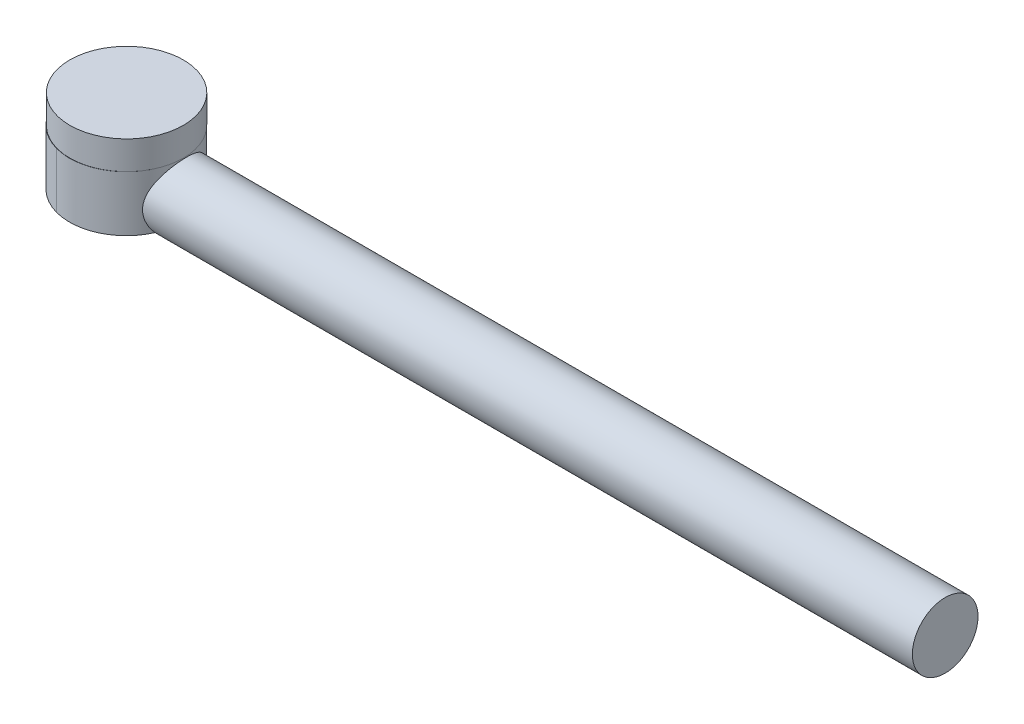
ISO-10303-21;
HEADER;
FILE_DESCRIPTION(('STEP AP214'),'2;1');
FILE_NAME('part.step','',(''),(''),'','','');
FILE_SCHEMA(('AUTOMOTIVE_DESIGN { 1 0 10303 214 1 1 1 1 }'));
ENDSEC;
DATA;
#1=APPLICATION_CONTEXT('core data for automotive mechanical design processes');
#2=APPLICATION_PROTOCOL_DEFINITION('international standard','automotive_design',2000,#1);
#3=PRODUCT_CONTEXT('',#1,'mechanical');
#4=PRODUCT('Part','Part','',(#3));
#5=PRODUCT_RELATED_PRODUCT_CATEGORY('part','',(#4));
#6=PRODUCT_DEFINITION_FORMATION('','',#4);
#7=PRODUCT_DEFINITION_CONTEXT('part definition',#1,'design');
#8=PRODUCT_DEFINITION('design','',#6,#7);
#9=PRODUCT_DEFINITION_SHAPE('','',#8);
#10=(LENGTH_UNIT() NAMED_UNIT(*) SI_UNIT(.MILLI.,.METRE.));
#11=(NAMED_UNIT(*) PLANE_ANGLE_UNIT() SI_UNIT($,.RADIAN.));
#12=(NAMED_UNIT(*) SI_UNIT($,.STERADIAN.) SOLID_ANGLE_UNIT());
#13=UNCERTAINTY_MEASURE_WITH_UNIT(LENGTH_MEASURE(1.E-05),#10,'distance_accuracy_value','');
#14=(GEOMETRIC_REPRESENTATION_CONTEXT(3) GLOBAL_UNCERTAINTY_ASSIGNED_CONTEXT((#13)) GLOBAL_UNIT_ASSIGNED_CONTEXT((#10,
#11,#12)) REPRESENTATION_CONTEXT('',''));
#15=CARTESIAN_POINT('',(0.,0.,0.));
#16=DIRECTION('',(0.,0.,1.));
#17=DIRECTION('',(1.,0.,0.));
#18=AXIS2_PLACEMENT_3D('',#15,#16,#17);
#19=CARTESIAN_POINT('',(85.8455921537652,56.2711130740514,55.1663814754269));
#20=DIRECTION('',(0.,-1.,0.));
#21=DIRECTION('',(0.,0.,-1.));
#22=AXIS2_PLACEMENT_3D('',#19,#20,#21);
#23=CYLINDRICAL_SURFACE('',#22,3.46216045673487);
#24=CARTESIAN_POINT('',(85.8455921537652,56.2711130740514,55.1663814754269));
#25=DIRECTION('',(0.,1.,0.));
#26=DIRECTION('',(0.263061764545742,0.,-0.964778994399277));
#27=AXIS2_PLACEMENT_3D('',#24,#25,#26);
#28=CIRCLE('',#27,3.46216045673486);
#29=CARTESIAN_POINT('',(86.7563541926543,56.2711130740514,51.8261617915293));
#30=VERTEX_POINT('',#29);
#31=EDGE_CURVE('E285',#30,#30,#28,.T.);
#32=ORIENTED_EDGE('',*,*,#31,.T.);
#33=EDGE_LOOP('',(#32));
#34=FACE_BOUND('',#33,.T.);
#35=CARTESIAN_POINT('',(85.8451387170964,52.6498767005646,58.6319286000939));
#36=CARTESIAN_POINT('',(85.9022781431992,52.6498767005646,58.6319330171962));
#37=CARTESIAN_POINT('',(85.9594204812359,52.6498767005646,58.6305673819269));
#38=CARTESIAN_POINT('',(86.0731646435422,52.6498767005646,58.6250696449926));
#39=CARTESIAN_POINT('',(86.1297674244005,52.6498767005646,58.6209572593628));
#40=CARTESIAN_POINT('',(86.242433194291,52.6498767005646,58.6099670734729));
#41=CARTESIAN_POINT('',(86.2984974702433,52.6498767005646,58.6031025163872));
#42=CARTESIAN_POINT('',(86.4100855726197,52.6498767005646,58.5866160643179));
#43=CARTESIAN_POINT('',(86.4656103551575,52.6498767005646,58.577000643534));
#44=CARTESIAN_POINT('',(86.5761200276653,52.6498767005646,58.5550189255727));
#45=CARTESIAN_POINT('',(86.6311048484214,52.6498767005646,58.5426522804193));
#46=CARTESIAN_POINT('',(86.7405357546421,52.6498767005646,58.5151752339513));
#47=CARTESIAN_POINT('',(86.7949800745156,52.6498767005646,58.5000578046358));
#48=CARTESIAN_POINT('',(86.9033316769709,52.6498767005646,58.4670852210716));
#49=CARTESIAN_POINT('',(86.9572348863243,52.6498767005646,58.4492166918067));
#50=CARTESIAN_POINT('',(87.0645071672621,52.6498767005646,58.4107503889644));
#51=CARTESIAN_POINT('',(87.1178693461341,52.6498767005646,58.3901334190223));
#52=CARTESIAN_POINT('',(87.2234828832721,52.6498767005646,58.3464067061153));
#53=CARTESIAN_POINT('',(87.2757355707485,52.6498767005646,58.3233001740664));
#54=CARTESIAN_POINT('',(87.3786873165212,52.6498767005646,58.2747271425663));
#55=CARTESIAN_POINT('',(87.4293946827911,52.6498767005646,58.2492782721121));
#56=CARTESIAN_POINT('',(87.5292579193038,52.6498767005646,58.1960289301901));
#57=CARTESIAN_POINT('',(87.5784198944581,52.6498767005646,58.1682399124995));
#58=CARTESIAN_POINT('',(87.6751945823478,52.6498767005646,58.1103159826552));
#59=CARTESIAN_POINT('',(87.7228104810345,52.6498767005646,58.0801863947181));
#60=CARTESIAN_POINT('',(87.8164960939139,52.6498767005646,58.0175876208643));
#61=CARTESIAN_POINT('',(87.8625654138706,52.6498767005646,57.9851178449527));
#62=CARTESIAN_POINT('',(87.953161687794,52.6498767005646,57.9178447103025));
#63=CARTESIAN_POINT('',(87.9976841056925,52.6498767005646,57.8830352444508));
#64=CARTESIAN_POINT('',(88.0851903880118,52.6498767005646,57.8110875939322));
#65=CARTESIAN_POINT('',(88.1281651419152,52.6498767005646,57.7739383335595));
#66=CARTESIAN_POINT('',(88.2125823553953,52.6498767005646,57.6973181266199));
#67=CARTESIAN_POINT('',(88.2540108672816,52.6498767005646,57.6578318261505));
#68=CARTESIAN_POINT('',(88.3348689748557,52.6498767005646,57.5769985280609));
#69=CARTESIAN_POINT('',(88.3743018829821,52.6498767005646,57.5356548442848));
#70=CARTESIAN_POINT('',(88.4508289493643,52.6498767005646,57.4513814368172));
#71=CARTESIAN_POINT('',(88.4879375313423,52.6498767005646,57.4084648226967));
#72=CARTESIAN_POINT('',(88.5598214507882,52.6498767005646,57.321052799695));
#73=CARTESIAN_POINT('',(88.5946068113079,52.6498767005646,57.2765656361548));
#74=CARTESIAN_POINT('',(88.6618484470639,52.6498767005646,57.1860168438093));
#75=CARTESIAN_POINT('',(88.6943097032658,52.6498767005646,57.1399589147686));
#76=CARTESIAN_POINT('',(88.7569084070072,52.6498767005646,57.0462732541047));
#77=CARTESIAN_POINT('',(88.7870452645401,52.6498767005646,56.9986451282661));
#78=CARTESIAN_POINT('',(88.8450009944314,52.6498767005646,56.9018231637735));
#79=CARTESIAN_POINT('',(88.8728133389145,52.6498767005646,56.8526254187572));
#80=CARTESIAN_POINT('',(88.9261254280582,52.6498767005646,56.7526672523529));
#81=CARTESIAN_POINT('',(88.9516125172107,52.6498767005646,56.7019000847931));
#82=CARTESIAN_POINT('',(89.0002825692125,52.6498767005646,56.5988071748745));
#83=CARTESIAN_POINT('',(89.0234467703912,52.6498767005646,56.5464725849089));
#84=CARTESIAN_POINT('',(89.0672163570395,52.6498767005646,56.4408492971016));
#85=CARTESIAN_POINT('',(89.0878260709565,52.6498767005646,56.3875623932372));
#86=CARTESIAN_POINT('',(89.1262778244476,52.6498767005646,56.280418276514));
#87=CARTESIAN_POINT('',(89.1441382066191,52.6498767005646,56.2265676556));
#88=CARTESIAN_POINT('',(89.1770991555188,52.6498767005646,56.1183006916261));
#89=CARTESIAN_POINT('',(89.1922121376947,52.6498767005646,56.0638881306124));
#90=CARTESIAN_POINT('',(89.2196837860514,52.6498767005646,55.9544996947017));
#91=CARTESIAN_POINT('',(89.2320484698829,52.6498767005646,55.8995253318088));
#92=CARTESIAN_POINT('',(89.254030180845,52.6498767005646,55.7890155806221));
#93=CARTESIAN_POINT('',(89.2636465120209,52.6498767005646,55.7334800539067));
#94=CARTESIAN_POINT('',(89.2801384629587,52.6498767005646,55.6218495249747));
#95=CARTESIAN_POINT('',(89.2870065568503,52.6498767005646,55.5657534118598));
#96=CARTESIAN_POINT('',(89.2980081706328,52.6498767005646,55.4530024545521));
#97=CARTESIAN_POINT('',(89.3021274167108,52.6498767005646,55.3963462207625));
#98=CARTESIAN_POINT('',(89.307640732981,52.6498767005646,55.2824755687892));
#99=CARTESIAN_POINT('',(89.3090140838173,52.6498767005646,55.2252601562631));
#100=CARTESIAN_POINT('',(89.309031626752,52.6498767005646,55.1109270668505));
#101=CARTESIAN_POINT('',(89.3076805043397,52.6498767005646,55.0538093909576));
#102=CARTESIAN_POINT('',(89.3022030140336,52.6498767005646,54.9401062854821));
#103=CARTESIAN_POINT('',(89.2980961151182,52.6498767005646,54.8835199266539));
#104=CARTESIAN_POINT('',(89.2871160877933,52.6498767005646,54.7708806855327));
#105=CARTESIAN_POINT('',(89.2802558770882,52.6498767005646,54.7148265462084));
#106=CARTESIAN_POINT('',(89.2637752286139,52.6498767005646,54.6032518644914));
#107=CARTESIAN_POINT('',(89.2541609290478,52.6498767005646,54.547730416153));
#108=CARTESIAN_POINT('',(89.2321791310013,52.6498767005646,54.4372206822885));
#109=CARTESIAN_POINT('',(89.2198109365709,52.6498767005646,54.3822325352077));
#110=CARTESIAN_POINT('',(89.1923283585253,52.6498767005646,54.2727881779326));
#111=CARTESIAN_POINT('',(89.17720659679,52.6498767005646,54.2183338214279));
#112=CARTESIAN_POINT('',(89.1442228392435,52.6498767005646,54.1099553843763));
#113=CARTESIAN_POINT('',(89.1263471243729,52.6498767005646,54.0560354823608));
#114=CARTESIAN_POINT('',(89.0878643524888,52.6498767005646,53.9487228628546));
#115=CARTESIAN_POINT('',(89.067237772768,52.6498767005646,53.8953371556654));
#116=CARTESIAN_POINT('',(89.0235006012374,52.6498767005646,53.7897004410775));
#117=CARTESIAN_POINT('',(89.0003943386356,52.6498767005646,53.7374476415377));
#118=CARTESIAN_POINT('',(88.9518215027788,52.6498767005646,53.6344958143968));
#119=CARTESIAN_POINT('',(88.9263725609076,52.6498767005646,53.5837884778295));
#120=CARTESIAN_POINT('',(88.8731231669847,52.6498767005646,53.4839252629441));
#121=CARTESIAN_POINT('',(88.8453341682908,52.6498767005646,53.4347632798891));
#122=CARTESIAN_POINT('',(88.7874102523185,52.6498767005646,53.3379885862301));
#123=CARTESIAN_POINT('',(88.75728065931,52.6498767005646,53.2903726896526));
#124=CARTESIAN_POINT('',(88.694681881742,52.6498767005646,53.196687078318));
#125=CARTESIAN_POINT('',(88.6622121071893,52.6498767005646,53.1506177577961));
#126=CARTESIAN_POINT('',(88.5949389735371,52.6498767005646,53.0600214834575));
#127=CARTESIAN_POINT('',(88.5601295073198,52.6498767005646,53.0154990657111));
#128=CARTESIAN_POINT('',(88.4881818565317,52.6498767005646,52.9279927835037));
#129=CARTESIAN_POINT('',(88.4510325962575,52.6498767005646,52.8850180295593));
#130=CARTESIAN_POINT('',(88.3744123893903,52.6498767005646,52.8006008160489));
#131=CARTESIAN_POINT('',(88.3349260888938,52.6498767005646,52.7591723041737));
#132=CARTESIAN_POINT('',(88.2540927907836,52.6498767005646,52.6783141966072));
#133=CARTESIAN_POINT('',(88.2127491070137,52.6498767005646,52.6388812884772));
#134=CARTESIAN_POINT('',(88.1284756995498,52.6498767005646,52.5623542220918));
#135=CARTESIAN_POINT('',(88.0855590854267,52.6498767005646,52.5252456401141));
#136=CARTESIAN_POINT('',(87.9981470624226,52.6498767005646,52.453361720668));
#137=CARTESIAN_POINT('',(87.9536598988826,52.6498767005646,52.4185763601479));
#138=CARTESIAN_POINT('',(87.863111106537,52.6498767005646,52.3513347243913));
#139=CARTESIAN_POINT('',(87.817053177496,52.6498767005646,52.3188734681894));
#140=CARTESIAN_POINT('',(87.723367516832,52.6498767005646,52.2562747644481));
#141=CARTESIAN_POINT('',(87.6757393909936,52.6498767005646,52.2261379069152));
#142=CARTESIAN_POINT('',(87.5789174265014,52.6498767005646,52.1681821770242));
#143=CARTESIAN_POINT('',(87.5297196814855,52.6498767005646,52.1403698325414));
#144=CARTESIAN_POINT('',(87.4297615150823,52.6498767005646,52.0870577433985));
#145=CARTESIAN_POINT('',(87.3789943475231,52.6498767005646,52.0615706542463));
#146=CARTESIAN_POINT('',(87.275901437606,52.6498767005646,52.0129006022457));
#147=CARTESIAN_POINT('',(87.2235668476413,52.6498767005646,51.9897364010676));
#148=CARTESIAN_POINT('',(87.1179435598343,52.6498767005646,51.9459668144199));
#149=CARTESIAN_POINT('',(87.0646566559692,52.6498767005646,51.9253571005029));
#150=CARTESIAN_POINT('',(86.9575125392449,52.6498767005646,51.8869053470118));
#151=CARTESIAN_POINT('',(86.9036619183304,52.6498767005646,51.8690449648403));
#152=CARTESIAN_POINT('',(86.7953949543559,52.6498767005646,51.8360840159406));
#153=CARTESIAN_POINT('',(86.7409823933419,52.6498767005646,51.8209710337647));
#154=CARTESIAN_POINT('',(86.6315939574309,52.6498767005646,51.7934993854081));
#155=CARTESIAN_POINT('',(86.5766195945379,52.6498767005646,51.7811347015765));
#156=CARTESIAN_POINT('',(86.4661098433512,52.6498767005646,51.7591529906144));
#157=CARTESIAN_POINT('',(86.4105743166359,52.6498767005646,51.7495366594386));
#158=CARTESIAN_POINT('',(86.2989437877042,52.6498767005646,51.7330447085007));
#159=CARTESIAN_POINT('',(86.2428476745896,52.6498767005646,51.7261766146092));
#160=CARTESIAN_POINT('',(86.1300967172826,52.6498767005646,51.7151750008267));
#161=CARTESIAN_POINT('',(86.0734404834934,52.6498767005646,51.7110557547486));
#162=CARTESIAN_POINT('',(85.9595698315213,52.6498767005646,51.7055424384785));
#163=CARTESIAN_POINT('',(85.9023544189958,52.6498767005646,51.7041690876421));
#164=CARTESIAN_POINT('',(85.7880213295831,52.6498767005646,51.7041515447074));
#165=CARTESIAN_POINT('',(85.7309036536896,52.6498767005646,51.7055026671197));
#166=CARTESIAN_POINT('',(85.617200548213,52.6498767005646,51.7109801574258));
#167=CARTESIAN_POINT('',(85.5606141893845,52.6498767005646,51.7150870563412));
#168=CARTESIAN_POINT('',(85.4479749482625,52.6498767005646,51.7260670836661));
#169=CARTESIAN_POINT('',(85.3919208089379,52.6498767005646,51.7329272943712));
#170=CARTESIAN_POINT('',(85.2803461272205,52.6498767005646,51.7494079428455));
#171=CARTESIAN_POINT('',(85.2248246788821,52.6498767005646,51.7590222424116));
#172=CARTESIAN_POINT('',(85.1143149450176,52.6498767005646,51.7810040404581));
#173=CARTESIAN_POINT('',(85.0593267979369,52.6498767005646,51.7933722348885));
#174=CARTESIAN_POINT('',(84.9498824406621,52.6498767005646,51.8208548129341));
#175=CARTESIAN_POINT('',(84.8954280841577,52.6498767005646,51.8359765746694));
#176=CARTESIAN_POINT('',(84.7870496471067,52.6498767005646,51.8689603322159));
#177=CARTESIAN_POINT('',(84.7331297450917,52.6498767005646,51.8868360470864));
#178=CARTESIAN_POINT('',(84.6258171255866,52.6498767005646,51.9253188189706));
#179=CARTESIAN_POINT('',(84.572431418398,52.6498767005646,51.9459453986915));
#180=CARTESIAN_POINT('',(84.4667947038108,52.6498767005646,51.9896825702223));
#181=CARTESIAN_POINT('',(84.414541904271,52.6498767005646,52.0127888328243));
#182=CARTESIAN_POINT('',(84.3115900771301,52.6498767005646,52.0613616686816));
#183=CARTESIAN_POINT('',(84.2608827405628,52.6498767005646,52.086810610553));
#184=CARTESIAN_POINT('',(84.1610195256774,52.6498767005646,52.1400600044762));
#185=CARTESIAN_POINT('',(84.1118575426224,52.6498767005646,52.1678490031702));
#186=CARTESIAN_POINT('',(84.0150828489634,52.6498767005646,52.2257729191427));
#187=CARTESIAN_POINT('',(83.9674669523859,52.6498767005646,52.2559025121512));
#188=CARTESIAN_POINT('',(83.8737813410513,52.6498767005646,52.3185012897192));
#189=CARTESIAN_POINT('',(83.8277120205294,52.6498767005646,52.3509710642718));
#190=CARTESIAN_POINT('',(83.7371157461908,52.6498767005646,52.4182441979239));
#191=CARTESIAN_POINT('',(83.6925933284444,52.6498767005646,52.4530536641411));
#192=CARTESIAN_POINT('',(83.605087046237,52.6498767005646,52.5250013149289));
#193=CARTESIAN_POINT('',(83.5621122922926,52.6498767005646,52.5621505752029));
#194=CARTESIAN_POINT('',(83.4776950787822,52.6498767005646,52.6387707820697));
#195=CARTESIAN_POINT('',(83.436266566907,52.6498767005646,52.6782570825659));
#196=CARTESIAN_POINT('',(83.3554084593411,52.6498767005646,52.759090380675));
#197=CARTESIAN_POINT('',(83.3159755512117,52.6498767005646,52.800434064444));
#198=CARTESIAN_POINT('',(83.2394484848274,52.6498767005646,52.8847074719063));
#199=CARTESIAN_POINT('',(83.2023399028502,52.6498767005646,52.9276240860288));
#200=CARTESIAN_POINT('',(83.1304559834048,52.6498767005646,53.0150361090319));
#201=CARTESIAN_POINT('',(83.0956706228849,52.6498767005646,53.0595232725715));
#202=CARTESIAN_POINT('',(83.0284289871287,52.6498767005646,53.1500720649166));
#203=CARTESIAN_POINT('',(82.9959677309269,52.6498767005646,53.1961299939574));
#204=CARTESIAN_POINT('',(82.9333690271855,52.6498767005646,53.2898156546215));
#205=CARTESIAN_POINT('',(82.9032321696526,52.6498767005646,53.33744378046));
#206=CARTESIAN_POINT('',(82.8452764397613,52.6498767005646,53.4342657449527));
#207=CARTESIAN_POINT('',(82.8174640952782,52.6498767005646,53.483463489969));
#208=CARTESIAN_POINT('',(82.7641520061346,52.6498767005646,53.5834216563732));
#209=CARTESIAN_POINT('',(82.738664916982,52.6498767005646,53.6341888239331));
#210=CARTESIAN_POINT('',(82.6899948649802,52.6498767005646,53.7372817338517));
#211=CARTESIAN_POINT('',(82.6668306638015,52.6498767005646,53.7896163238173));
#212=CARTESIAN_POINT('',(82.6230610771532,52.6498767005646,53.8952396116245));
#213=CARTESIAN_POINT('',(82.6024513632362,52.6498767005646,53.948526515489));
#214=CARTESIAN_POINT('',(82.5639996097451,52.6498767005646,54.0556706322121));
#215=CARTESIAN_POINT('',(82.5461392275736,52.6498767005646,54.1095212531262));
#216=CARTESIAN_POINT('',(82.5131782786739,52.6498767005646,54.2177882171));
#217=CARTESIAN_POINT('',(82.498065296498,52.6498767005646,54.2722007781138));
#218=CARTESIAN_POINT('',(82.4705936481413,52.6498767005646,54.3815892140244));
#219=CARTESIAN_POINT('',(82.4582289643098,52.6498767005646,54.4365635769174));
#220=CARTESIAN_POINT('',(82.4362472533477,52.6498767005646,54.547073328104));
#221=CARTESIAN_POINT('',(82.4266309221718,52.6498767005646,54.6026088548194));
#222=CARTESIAN_POINT('',(82.410138971234,52.6498767005646,54.7142393837514));
#223=CARTESIAN_POINT('',(82.4032708773424,52.6498767005646,54.7703354968664));
#224=CARTESIAN_POINT('',(82.3922692635599,52.6498767005646,54.883086454174));
#225=CARTESIAN_POINT('',(82.3881500174819,52.6498767005646,54.9397426879637));
#226=CARTESIAN_POINT('',(82.3826367012117,52.6498767005646,55.0536133399369));
#227=CARTESIAN_POINT('',(82.3812633503754,52.6498767005646,55.1108287524631));
#228=CARTESIAN_POINT('',(82.3812458074407,52.6498767005646,55.2251618418759));
#229=CARTESIAN_POINT('',(82.382596929853,52.6498767005646,55.2822795177691));
#230=CARTESIAN_POINT('',(82.3880744201591,52.6498767005646,55.3959826232451));
#231=CARTESIAN_POINT('',(82.3921813190745,52.6498767005646,55.4525689820734));
#232=CARTESIAN_POINT('',(82.4031613463994,52.6498767005646,55.5652082231949));
#233=CARTESIAN_POINT('',(82.4100215571045,52.6498767005646,55.6212623625194));
#234=CARTESIAN_POINT('',(82.4265022055788,52.6498767005646,55.7328370442365));
#235=CARTESIAN_POINT('',(82.4361165051449,52.6498767005646,55.7883584925749));
#236=CARTESIAN_POINT('',(82.4580983031914,52.6498767005646,55.8988682264394));
#237=CARTESIAN_POINT('',(82.4704664976218,52.6498767005646,55.9538563735201));
#238=CARTESIAN_POINT('',(82.4979490756674,52.6498767005646,56.0633007307951));
#239=CARTESIAN_POINT('',(82.5130708374027,52.6498767005646,56.1177550872996));
#240=CARTESIAN_POINT('',(82.5460545949492,52.6498767005646,56.226133524351));
#241=CARTESIAN_POINT('',(82.5639303098198,52.6498767005646,56.2800534263663));
#242=CARTESIAN_POINT('',(82.6024130817039,52.6498767005646,56.3873660458721));
#243=CARTESIAN_POINT('',(82.6230396614248,52.6498767005646,56.4407517530611));
#244=CARTESIAN_POINT('',(82.6667768329555,52.6498767005646,56.5463884676488));
#245=CARTESIAN_POINT('',(82.6898830955575,52.6498767005646,56.5986412671888));
#246=CARTESIAN_POINT('',(82.7384559314146,52.6498767005646,56.70159309433));
#247=CARTESIAN_POINT('',(82.763904873286,52.6498767005646,56.7523004308974));
#248=CARTESIAN_POINT('',(82.817154267209,52.6498767005646,56.8521636457831));
#249=CARTESIAN_POINT('',(82.844943265903,52.6498767005646,56.9013256288381));
#250=CARTESIAN_POINT('',(82.9028671818755,52.6498767005646,56.9981003224972));
#251=CARTESIAN_POINT('',(82.932996774884,52.6498767005646,57.0457162190747));
#252=CARTESIAN_POINT('',(82.9955955524519,52.6498767005646,57.1394018304095));
#253=CARTESIAN_POINT('',(83.0280653270045,52.6498767005646,57.1854711509314));
#254=CARTESIAN_POINT('',(83.0953384606568,52.6498767005646,57.2760674252695));
#255=CARTESIAN_POINT('',(83.1301479268742,52.6498767005646,57.3205898430154));
#256=CARTESIAN_POINT('',(83.2020955776615,52.6498767005646,57.408096125224));
#257=CARTESIAN_POINT('',(83.2392448379348,52.6498767005646,57.4510708791702));
#258=CARTESIAN_POINT('',(83.3158650448039,52.6498767005646,57.535488092675));
#259=CARTESIAN_POINT('',(83.3553513453032,52.6498767005646,57.5769166045428));
#260=CARTESIAN_POINT('',(83.4361846434046,52.6498767005646,57.6577747121283));
#261=CARTESIAN_POINT('',(83.4775283271629,52.6498767005646,57.6972076202847));
#262=CARTESIAN_POINT('',(83.5618017346564,52.6498767005646,57.7737346865964));
#263=CARTESIAN_POINT('',(83.6047183488204,52.6498767005646,57.8108432684749));
#264=CARTESIAN_POINT('',(83.6921303717115,52.6498767005646,57.8827271881902));
#265=CARTESIAN_POINT('',(83.7366175350986,52.6498767005646,57.9175125490765));
#266=CARTESIAN_POINT('',(83.8271663278612,52.6498767005646,57.9847541838321));
#267=CARTESIAN_POINT('',(83.8732242574704,52.6498767005646,58.0172154386707));
#268=CARTESIAN_POINT('',(83.9669099165809,52.6498767005646,58.0798141461386));
#269=CARTESIAN_POINT('',(84.0145380402969,52.6498767005646,58.109951008763));
#270=CARTESIAN_POINT('',(84.1113600105958,52.6498767005646,58.1679067247254));
#271=CARTESIAN_POINT('',(84.1605577635683,52.6498767005646,58.1957190501225));
#272=CARTESIAN_POINT('',(84.2605159081889,52.6498767005646,58.2490311915197));
#273=CARTESIAN_POINT('',(84.3112830458143,52.6498767005646,58.2745183524782));
#274=CARTESIAN_POINT('',(84.4143760377466,52.6498767005646,58.3231882077428));
#275=CARTESIAN_POINT('',(84.4667107407288,52.6498767005646,58.3463521378158));
#276=CARTESIAN_POINT('',(84.5723572245587,52.6498767005646,58.390132203654));
#277=CARTESIAN_POINT('',(84.6256676760693,52.6498767005646,58.4107515468084));
#278=CARTESIAN_POINT('',(84.7328521664621,52.6498767005646,58.4492198034285));
#279=CARTESIAN_POINT('',(84.7867194949819,52.6498767005646,58.4670873878519));
#280=CARTESIAN_POINT('',(84.8950133139161,52.6498767005646,58.5000595261592));
#281=CARTESIAN_POINT('',(84.9494359167319,52.6498767005646,58.5151768404915));
#282=CARTESIAN_POINT('',(85.0588378245983,52.6498767005646,58.5426540550997));
#283=CARTESIAN_POINT('',(85.1138155293695,52.6498767005646,58.5550203236229));
#284=CARTESIAN_POINT('',(85.2243253074839,52.6498767005646,58.5770020258431));
#285=CARTESIAN_POINT('',(85.2798574500392,52.6498767005646,58.5866171115437));
#286=CARTESIAN_POINT('',(85.3914746761229,52.6498767005646,58.6031035801116));
#287=CARTESIAN_POINT('',(85.447560821001,52.6498767005646,58.609967773859));
#288=CARTESIAN_POINT('',(85.5602847423708,52.6498767005646,58.6209579624449));
#289=CARTESIAN_POINT('',(85.6169238744803,52.6498767005646,58.625069997536));
#290=CARTESIAN_POINT('',(85.7307552579135,52.6498767005646,58.6305677194748));
#291=CARTESIAN_POINT('',(85.7879484991647,52.6498767005646,58.6319329905889));
#292=CARTESIAN_POINT('',(85.8451387170964,52.6498767005646,58.6319286000939));
#293=B_SPLINE_CURVE_WITH_KNOTS('',3,(#35,#36,#37,#38,#39,#40,#41,#42,#43,#44,#45,#46,#47,#48,
#49,#50,#51,#52,#53,#54,#55,#56,#57,#58,#59,#60,#61,#62,#63,#64,#65,#66,#67,#68,#69,#70,#71,#72,
#73,#74,#75,#76,#77,#78,#79,#80,#81,#82,#83,#84,#85,#86,#87,#88,#89,#90,#91,#92,#93,#94,#95,#96,
#97,#98,#99,#100,#101,#102,#103,#104,#105,#106,#107,#108,#109,#110,#111,#112,#113,#114,#115,
#116,#117,#118,#119,#120,#121,#122,#123,#124,#125,#126,#127,#128,#129,#130,#131,#132,#133,#134,
#135,#136,#137,#138,#139,#140,#141,#142,#143,#144,#145,#146,#147,#148,#149,#150,#151,#152,#153,
#154,#155,#156,#157,#158,#159,#160,#161,#162,#163,#164,#165,#166,#167,#168,#169,#170,#171,#172,
#173,#174,#175,#176,#177,#178,#179,#180,#181,#182,#183,#184,#185,#186,#187,#188,#189,#190,#191,
#192,#193,#194,#195,#196,#197,#198,#199,#200,#201,#202,#203,#204,#205,#206,#207,#208,#209,#210,
#211,#212,#213,#214,#215,#216,#217,#218,#219,#220,#221,#222,#223,#224,#225,#226,#227,#228,#229,
#230,#231,#232,#233,#234,#235,#236,#237,#238,#239,#240,#241,#242,#243,#244,#245,#246,#247,#248,
#249,#250,#251,#252,#253,#254,#255,#256,#257,#258,#259,#260,#261,#262,#263,#264,#265,#266,#267,
#268,#269,#270,#271,#272,#273,#274,#275,#276,#277,#278,#279,#280,#281,#282,#283,#284,#285,#286,
#287,#288,#289,#290,#291,#292),.UNSPECIFIED.,.F.,.F.,(4,2,2,2,2,2,2,2,2,2,2,2,2,2,2,2,2,2,2,2,2,
2,2,2,2,2,2,2,2,2,2,2,2,2,2,2,2,2,2,2,2,2,2,2,2,2,2,2,2,2,2,2,2,2,2,2,2,2,2,2,2,2,2,2,2,2,2,2,2,
2,2,2,2,2,2,2,2,2,2,2,2,2,2,2,2,2,2,2,2,2,2,2,2,2,2,2,2,2,2,2,2,2,2,2,2,2,2,2,2,2,2,2,2,2,2,2,2,
2,2,2,2,2,2,2,2,2,2,2,4),(0.,0.171406034270473,0.341594760706496,0.51097420050286,
0.679958237156565,0.848963659140803,1.01840709712114,1.18870196694212,1.36025552912706,
1.53159042017548,1.70172743527465,1.87107537987785,2.04004878664351,2.20906494405116,
2.37854082479497,2.54889002573566,2.72051983021773,2.89185472126497,3.06199173636329,
3.23133968096597,3.40031308773145,3.56932924513927,3.73880512588364,3.90915432682524,
4.08078413130861,4.25211902235761,4.42225603745717,4.5916039820606,4.76057738882633,
4.92959354623392,5.09906942697754,5.26941862791793,5.44104843239962,5.61238332344792,
5.78252033854701,5.95186828315017,6.12084168991581,6.28985784732348,6.45933372806734,
6.62968292900808,6.80131273349024,6.97264762453835,7.14278463963727,7.31213258424031,
7.48110599100591,7.65012214841362,7.81959802915763,7.98994723009868,8.16157703458128,
8.33291192563176,8.50304894073239,8.67239688533646,8.84137029210241,9.01038644950978,
9.17986233025275,9.35021153119205,9.52184133567223,9.69317622672298,9.86331324182382,
10.032661186428,10.201634593194,10.3706507506013,10.5401266313442,10.7104758322832,
10.882105636763,11.0534405278132,11.2235775429136,11.3929254875176,11.5618988942835,
11.7309150516909,11.900390932434,12.0707401333735,12.2423699378539,12.4137048289023,
12.5838418440015,12.7531897886047,12.9221631953703,13.091179352778,13.2606552335218,
13.4310044344625,13.6026342389445,13.7739691299918,13.9441061450901,14.1134540896928,
14.2824274964583,14.4514436538661,14.6209195346105,14.791268735552,14.9628985400354,
15.1342334310844,15.304370446184,15.4737183907874,15.6426917975531,15.8117079549607,
15.9811838357044,16.1515330366447,16.3231628411264,16.4944977321755,16.6646347472752,
16.8339826918786,17.0029560986444,17.171972256052,17.3414481367955,17.5117973377357,
17.6834271422171,17.854762033266,18.0248990483654,18.1942469929688,18.3632203997345,
18.5322365571421,18.7017124378858,18.8720616388263,19.0436914433081,19.2150263343567,
19.385163349456,19.5545112940592,19.7234847008249,19.8925008582325,20.0619767389763,
20.2323259399169,20.4039557443988,20.5753669548362,20.7455583552642,20.9149387742715,
21.0839229266467,21.2529284443442,21.4223728013403,21.5926702442772,21.7642288403056),.UNSPECIFIED.);
#294=CARTESIAN_POINT('',(85.8451387170964,52.6498767005646,58.6319286000939));
#295=VERTEX_POINT('',#294);
#296=EDGE_CURVE('E218',#295,#295,#293,.T.);
#297=ORIENTED_EDGE('',*,*,#296,.F.);
#298=EDGE_LOOP('',(#297));
#299=FACE_BOUND('',#298,.T.);
#300=ADVANCED_FACE('F47',(#34,#299),#23,.F.);
#301=CARTESIAN_POINT('',(85.8451387170964,57.3338139318963,55.1680444543631));
#302=DIRECTION('',(0.,-1.,0.));
#303=DIRECTION('',(0.,0.,-1.));
#304=AXIS2_PLACEMENT_3D('',#301,#302,#303);
#305=CYLINDRICAL_SURFACE('',#304,4.41488839314275);
#306=CARTESIAN_POINT('',(85.8451387170964,52.6498767005646,55.1680444543631));
#307=DIRECTION('',(0.,-1.,0.));
#308=DIRECTION('',(0.,0.,-1.));
#309=AXIS2_PLACEMENT_3D('',#306,#307,#308);
#310=CIRCLE('',#309,4.41488839314275);
#311=CARTESIAN_POINT('',(89.8570877583521,52.6498767005646,53.3253550029705));
#312=VERTEX_POINT('',#311);
#313=CARTESIAN_POINT('',(89.9429661050284,52.6498767005646,56.810923093405));
#314=VERTEX_POINT('',#313);
#315=EDGE_CURVE('E220',#312,#314,#310,.T.);
#316=ORIENTED_EDGE('',*,*,#315,.F.);
#317=CARTESIAN_POINT('',(89.9429661050284,52.6498767005646,56.810923093405));
#318=CARTESIAN_POINT('',(89.9598691618483,52.6016003833653,56.7687617533724));
#319=CARTESIAN_POINT('',(89.9768067955959,52.5550984496613,56.7246283098016));
#320=CARTESIAN_POINT('',(90.0103291865865,52.4658412597583,56.6325690599469));
#321=CARTESIAN_POINT('',(90.0269138220548,52.4230872811348,56.5846419710252));
#322=CARTESIAN_POINT('',(90.0755993602319,52.3005096451873,56.4350989422909));
#323=CARTESIAN_POINT('',(90.1065088979095,52.2267076482058,56.3280154246226));
#324=CARTESIAN_POINT('',(90.1618235556331,52.0973748785392,56.1013795489201));
#325=CARTESIAN_POINT('',(90.1862103653144,52.0418954400152,55.9817933742973));
#326=CARTESIAN_POINT('',(90.2254281017248,51.9518590970684,55.7337230064818));
#327=CARTESIAN_POINT('',(90.2402811026526,51.9172538726108,55.6052601362031));
#328=CARTESIAN_POINT('',(90.2578017621292,51.8723307268605,55.3534183138647));
#329=CARTESIAN_POINT('',(90.2613058487256,51.8603742627657,55.2303893826729));
#330=CARTESIAN_POINT('',(90.2579111270485,51.8562143034585,54.9841073262146));
#331=CARTESIAN_POINT('',(90.2510109297167,51.8640134458779,54.860854173207));
#332=CARTESIAN_POINT('',(90.2280666118155,51.8977738442603,54.6255276896892));
#333=CARTESIAN_POINT('',(90.2126043068301,51.9226013287298,54.513230385023));
#334=CARTESIAN_POINT('',(90.1742057401821,51.9880883900836,54.2946966816406));
#335=CARTESIAN_POINT('',(90.1512668847251,52.0287534623619,54.1884624013844));
#336=CARTESIAN_POINT('',(90.0982548552144,52.1270579813108,53.9786799608336));
#337=CARTESIAN_POINT('',(90.0678615316645,52.185500293576,53.8755920864951));
#338=CARTESIAN_POINT('',(90.0031077546218,52.3166317011211,53.680395712154));
#339=CARTESIAN_POINT('',(89.9687499623801,52.3893112618856,53.5882799302977));
#340=CARTESIAN_POINT('',(89.9210487476378,52.4969467631521,53.4711832581662));
#341=CARTESIAN_POINT('',(89.9082588355418,52.5264455469262,53.4408115007047));
#342=CARTESIAN_POINT('',(89.8826613139499,52.5869970260982,53.381796838938));
#343=CARTESIAN_POINT('',(89.8698537854115,52.6180466334873,53.3531507313034));
#344=CARTESIAN_POINT('',(89.8570877583521,52.6498767005646,53.3253550029705));
#345=B_SPLINE_CURVE_WITH_KNOTS('',3,(#317,#318,#319,#320,#321,#322,#323,#324,#325,#326,#327,
#328,#329,#330,#331,#332,#333,#334,#335,#336,#337,#338,#339,#340,#341,#342,#343,#344),
.UNSPECIFIED.,.F.,.F.,(4,2,2,2,2,2,2,2,2,2,2,2,2,4),(0.,0.198746322642274,0.397560131155452,
0.796564027129921,1.19667650861936,1.59585921179006,1.96485942895716,2.33390891507627,
2.68050697655425,3.02722540941497,3.39279986113569,3.75813032385048,3.89077198239731,
4.02315930678074),.UNSPECIFIED.);
#346=EDGE_CURVE('E178',#314,#312,#345,.T.);
#347=ORIENTED_EDGE('',*,*,#346,.F.);
#348=EDGE_LOOP('',(#316,#347));
#349=FACE_BOUND('',#348,.T.);
#350=ADVANCED_FACE('F194',(#349),#305,.F.);
#351=CARTESIAN_POINT('',(137.955983550691,54.1716158859326,55.0681390481877));
#352=DIRECTION('',(-1.,0.,0.));
#353=DIRECTION('',(0.,0.,1.));
#354=AXIS2_PLACEMENT_3D('',#351,#352,#353);
#355=CYLINDRICAL_SURFACE('',#354,2.31365217276674);
#356=CARTESIAN_POINT('',(89.4954774771804,52.6498767005646,56.810923093405));
#357=CARTESIAN_POINT('',(89.4590070959086,52.7439531886695,56.8930642463133));
#358=CARTESIAN_POINT('',(89.4224976170564,52.8448198490282,56.9677075817659));
#359=CARTESIAN_POINT('',(89.3532605097125,53.0590733863414,57.1006913360713));
#360=CARTESIAN_POINT('',(89.320563935248,53.172550105198,57.1589027245781));
#361=CARTESIAN_POINT('',(89.2633745792603,53.409978328677,57.2566123727102));
#362=CARTESIAN_POINT('',(89.2389177596325,53.5339728673882,57.2960289060753));
#363=CARTESIAN_POINT('',(89.2025914627776,53.7881982556527,57.353494285403));
#364=CARTESIAN_POINT('',(89.1906713069015,53.9184017552517,57.3716291956726));
#365=CARTESIAN_POINT('',(89.1820947106429,54.1657101593968,57.3847156029197));
#366=CARTESIAN_POINT('',(89.1838705493253,54.2826389412691,57.3820478660282));
#367=CARTESIAN_POINT('',(89.1987213271506,54.5141348096543,57.3592541383528));
#368=CARTESIAN_POINT('',(89.2118071870916,54.628699503933,57.3391112737591));
#369=CARTESIAN_POINT('',(89.2463856677294,54.8463749177602,57.2839150906157));
#370=CARTESIAN_POINT('',(89.2674142346923,54.9497717750419,57.2496768130426));
#371=CARTESIAN_POINT('',(89.3154159609968,55.1495565896683,57.1677308382468));
#372=CARTESIAN_POINT('',(89.342390075471,55.2459434175621,57.1200209765119));
#373=CARTESIAN_POINT('',(89.403680798428,55.4431932682409,57.0048525110084));
#374=CARTESIAN_POINT('',(89.4384969857469,55.5428405659075,56.9355778078344));
#375=CARTESIAN_POINT('',(89.5089478524433,55.7300241760106,56.7824870202407));
#376=CARTESIAN_POINT('',(89.5445832077391,55.8175500354792,56.6986585239521));
#377=CARTESIAN_POINT('',(89.6172791592876,55.9881267423963,56.5074092164656));
#378=CARTESIAN_POINT('',(89.6540387819996,56.0695287347881,56.3983880935032));
#379=CARTESIAN_POINT('',(89.7201670264831,56.2127056371899,56.166100054534));
#380=CARTESIAN_POINT('',(89.7495395683988,56.2744909618768,56.0428407452841));
#381=CARTESIAN_POINT('',(89.7957221390576,56.3726197516922,55.7930375008348));
#382=CARTESIAN_POINT('',(89.8131764819838,56.410259929405,55.6671270160902));
#383=CARTESIAN_POINT('',(89.8358705082137,56.4636749317028,55.4097227723265));
#384=CARTESIAN_POINT('',(89.8411224018552,56.4794716074957,55.2782347287838));
#385=CARTESIAN_POINT('',(89.8386292187291,56.4878769225977,55.0304712290377));
#386=CARTESIAN_POINT('',(89.8323639475758,56.4830337060445,54.9142578539967));
#387=CARTESIAN_POINT('',(89.8100377796867,56.4562121373517,54.6848050519054));
#388=CARTESIAN_POINT('',(89.793976742134,56.434233538885,54.5715656676315));
#389=CARTESIAN_POINT('',(89.7535815594992,56.3747099645818,54.35253828453));
#390=CARTESIAN_POINT('',(89.7293602652326,56.3373758674946,54.2466712246981));
#391=CARTESIAN_POINT('',(89.6743660613505,56.2486704720293,54.0428610700159));
#392=CARTESIAN_POINT('',(89.6435917314116,56.1972961298437,53.9449196993628));
#393=CARTESIAN_POINT('',(89.5740287009397,56.0758766221284,53.7484817499145));
#394=CARTESIAN_POINT('',(89.5347357174044,56.0044267573872,53.6510341810287));
#395=CARTESIAN_POINT('',(89.453640512294,55.8478588144628,53.468874080064));
#396=CARTESIAN_POINT('',(89.4118352996226,55.7627242327667,53.3841771669374));
#397=CARTESIAN_POINT('',(89.3237943890579,55.5685863168315,53.2188923217909));
#398=CARTESIAN_POINT('',(89.2776673715044,55.4579258699582,53.1401801786994));
#399=CARTESIAN_POINT('',(89.1918847265942,55.2226729813133,53.0025204790307));
#400=CARTESIAN_POINT('',(89.152221257834,55.0980977347023,52.9435488807569));
#401=CARTESIAN_POINT('',(89.0931780358208,54.8675209789131,52.8590435051935));
#402=CARTESIAN_POINT('',(89.0712300981536,54.7638592341839,52.8289351166218));
#403=CARTESIAN_POINT('',(89.0374893962923,54.5518113577121,52.7833725626233));
#404=CARTESIAN_POINT('',(89.0256827416442,54.4434319023993,52.7678983499083));
#405=CARTESIAN_POINT('',(89.0139200891606,54.224479977139,52.7524802176354));
#406=CARTESIAN_POINT('',(89.0140100277929,54.1139006550329,52.7525964978709));
#407=CARTESIAN_POINT('',(89.0261441788288,53.894536711862,52.7685046550474));
#408=CARTESIAN_POINT('',(89.0381928339325,53.7857527730566,52.7843023576853));
#409=CARTESIAN_POINT('',(89.0716002126872,53.578308655479,52.8294546785929));
#410=CARTESIAN_POINT('',(89.0924770244923,53.4794134484892,52.8581117002139));
#411=CARTESIAN_POINT('',(89.1410954826625,53.2876940003463,52.9275598122458));
#412=CARTESIAN_POINT('',(89.1688450815152,53.1948769506441,52.9683649703695));
#413=CARTESIAN_POINT('',(89.2265424379206,53.0229872343316,53.0575835125573));
#414=CARTESIAN_POINT('',(89.2561833056056,52.9434058997933,53.105227201183));
#415=CARTESIAN_POINT('',(89.3173300089305,52.7913219924013,53.2090549037144));
#416=CARTESIAN_POINT('',(89.3488276620466,52.7187916189296,53.2652029408842));
#417=CARTESIAN_POINT('',(89.3804377202878,52.6498767005646,53.3253550029705));
#418=B_SPLINE_CURVE_WITH_KNOTS('',3,(#356,#357,#358,#359,#360,#361,#362,#363,#364,#365,#366,
#367,#368,#369,#370,#371,#372,#373,#374,#375,#376,#377,#378,#379,#380,#381,#382,#383,#384,#385,
#386,#387,#388,#389,#390,#391,#392,#393,#394,#395,#396,#397,#398,#399,#400,#401,#402,#403,#404,
#405,#406,#407,#408,#409,#410,#411,#412,#413,#414,#415,#416,#417),.UNSPECIFIED.,.F.,.F.,(4,2,2,
2,2,2,2,2,2,2,2,2,2,2,2,2,2,2,2,2,2,2,2,2,2,2,2,2,2,2,4),(0.,0.390241286275457,
0.783466681757577,1.17838670135114,1.57170407325067,1.92072892610733,2.27009116946562,
2.60159030639108,2.93314273642647,3.31041716073554,3.68801492973468,4.10867766020668,
4.52911668189437,4.92450104713221,5.31948960168543,5.667220976659,6.01495735048679,
6.35806973189139,6.70125655627354,7.0809465086823,7.46109784374455,7.88934817110292,
8.31707502532974,8.64618555947265,8.97484459078756,9.30477271432826,9.63482345307508,
9.94880274100355,10.2631470450824,10.5546173906287,10.8448874698322),.UNSPECIFIED.);
#419=CARTESIAN_POINT('',(89.4954774771804,52.6498767005646,56.810923093405));
#420=VERTEX_POINT('',#419);
#421=CARTESIAN_POINT('',(89.4949980093026,52.6511130740515,56.8120018798376));
#422=VERTEX_POINT('',#421);
#423=EDGE_CURVE('E147',#420,#422,#418,.T.);
#424=ORIENTED_EDGE('',*,*,#423,.F.);
#425=DIRECTION('',(-1.,0.,0.));
#426=VECTOR('',#425,1.);
#427=CARTESIAN_POINT('',(137.955983550691,52.6498767005646,56.810923093405));
#428=LINE('',#427,#426);
#429=EDGE_CURVE('E188',#420,#314,#428,.F.);
#430=ORIENTED_EDGE('',*,*,#429,.T.);
#431=ORIENTED_EDGE('',*,*,#346,.T.);
#432=DIRECTION('',(-1.,0.,0.));
#433=VECTOR('',#432,1.);
#434=CARTESIAN_POINT('',(137.955983550691,52.6498767005646,53.3253550029705));
#435=LINE('',#434,#433);
#436=CARTESIAN_POINT('',(89.3804377202878,52.6498767005646,53.3253550029705));
#437=VERTEX_POINT('',#436);
#438=EDGE_CURVE('E187',#312,#437,#435,.T.);
#439=ORIENTED_EDGE('',*,*,#438,.T.);
#440=CARTESIAN_POINT('',(89.3798702932817,52.6511130740515,53.3242762165379));
#441=VERTEX_POINT('',#440);
#442=EDGE_CURVE('E219',#441,#437,#418,.T.);
#443=ORIENTED_EDGE('',*,*,#442,.F.);
#444=DIRECTION('',(-1.,0.,0.));
#445=VECTOR('',#444,1.);
#446=CARTESIAN_POINT('',(137.955983550691,52.6511130740514,53.3242762165379));
#447=LINE('',#446,#445);
#448=CARTESIAN_POINT('',(89.5190719347014,52.6511130740514,53.3242762165379));
#449=VERTEX_POINT('',#448);
#450=EDGE_CURVE('E319',#449,#441,#447,.T.);
#451=ORIENTED_EDGE('',*,*,#450,.F.);
#452=ORIENTED_EDGE('',*,*,#450,.T.);
#453=EDGE_CURVE('E164',#422,#441,#418,.T.);
#454=ORIENTED_EDGE('',*,*,#453,.F.);
#455=DIRECTION('',(-1.,0.,0.));
#456=VECTOR('',#455,1.);
#457=CARTESIAN_POINT('',(137.955983550691,52.6511130740514,56.8120018798376));
#458=LINE('',#457,#456);
#459=CARTESIAN_POINT('',(89.6121663640159,52.6511130740514,56.8120018798376));
#460=VERTEX_POINT('',#459);
#461=EDGE_CURVE('E318',#422,#460,#458,.F.);
#462=ORIENTED_EDGE('',*,*,#461,.T.);
#463=ORIENTED_EDGE('',*,*,#461,.F.);
#464=EDGE_LOOP('',(#424,#430,#431,#439,#443,#451,#452,#454,#462,#463));
#465=FACE_BOUND('',#464,.T.);
#466=CARTESIAN_POINT('',(143.455983550691,54.1716158859326,55.0681390481877));
#467=DIRECTION('',(1.,0.,0.));
#468=DIRECTION('',(0.,0.,-1.));
#469=AXIS2_PLACEMENT_3D('',#466,#467,#468);
#470=CIRCLE('',#469,2.31365217276674);
#471=CARTESIAN_POINT('',(143.455983550691,54.1716158859326,52.754486875421));
#472=VERTEX_POINT('',#471);
#473=EDGE_CURVE('E345',#472,#472,#470,.T.);
#474=ORIENTED_EDGE('',*,*,#473,.F.);
#475=EDGE_LOOP('',(#474));
#476=FACE_BOUND('',#475,.T.);
#477=ADVANCED_FACE('F190',(#465,#476),#355,.T.);
#478=CARTESIAN_POINT('',(85.8400006943751,56.5538758021105,55.186888152164));
#479=DIRECTION('',(0.,-1.,0.));
#480=DIRECTION('',(-0.964778994398282,0.,-0.263061764549393));
#481=AXIS2_PLACEMENT_3D('',#478,#479,#480);
#482=CYLINDRICAL_SURFACE('',#481,4.);
#483=ORIENTED_EDGE('',*,*,#453,.T.);
#484=CARTESIAN_POINT('',(85.8400006943751,52.6511130740514,55.186888152164));
#485=DIRECTION('',(0.,1.,0.));
#486=DIRECTION('',(0.,0.,1.));
#487=AXIS2_PLACEMENT_3D('',#484,#485,#486);
#488=CIRCLE('',#487,4.);
#489=CARTESIAN_POINT('',(86.8922477525727,52.6511130740514,51.3277721745709));
#490=VERTEX_POINT('',#489);
#491=EDGE_CURVE('E152',#441,#490,#488,.T.);
#492=ORIENTED_EDGE('',*,*,#491,.T.);
#493=DIRECTION('',(0.,-1.,0.));
#494=VECTOR('',#493,1.);
#495=CARTESIAN_POINT('',(86.8922477525727,56.5538758021105,51.3277721745709));
#496=LINE('',#495,#494);
#497=CARTESIAN_POINT('',(86.8922477525727,56.5538758021105,51.3277721745709));
#498=VERTEX_POINT('',#497);
#499=EDGE_CURVE('E159',#498,#490,#496,.T.);
#500=ORIENTED_EDGE('',*,*,#499,.F.);
#501=CARTESIAN_POINT('',(85.8400006943751,56.5538758021105,55.186888152164));
#502=DIRECTION('',(0.,1.,0.));
#503=DIRECTION('',(0.964778994398282,0.,0.263061764549393));
#504=AXIS2_PLACEMENT_3D('',#501,#502,#503);
#505=CIRCLE('',#504,4.);
#506=CARTESIAN_POINT('',(89.6019871861455,56.5538758021105,56.5461002900354));
#507=VERTEX_POINT('',#506);
#508=EDGE_CURVE('E176',#507,#498,#505,.T.);
#509=ORIENTED_EDGE('',*,*,#508,.F.);
#510=CARTESIAN_POINT('',(84.7877536361776,56.5538758021105,59.0460041297571));
#511=VERTEX_POINT('',#510);
#512=EDGE_CURVE('E121',#511,#507,#505,.T.);
#513=ORIENTED_EDGE('',*,*,#512,.F.);
#514=DIRECTION('',(0.,-1.,0.));
#515=VECTOR('',#514,1.);
#516=CARTESIAN_POINT('',(84.7877536361775,56.5538758021105,59.0460041297571));
#517=LINE('',#516,#515);
#518=CARTESIAN_POINT('',(84.7877536361775,52.6511130740514,59.0460041297571));
#519=VERTEX_POINT('',#518);
#520=EDGE_CURVE('E115',#511,#519,#517,.T.);
#521=ORIENTED_EDGE('',*,*,#520,.T.);
#522=EDGE_CURVE('E142',#519,#422,#488,.T.);
#523=ORIENTED_EDGE('',*,*,#522,.T.);
#524=EDGE_LOOP('',(#483,#492,#500,#509,#513,#521,#523));
#525=FACE_BOUND('',#524,.T.);
#526=ADVANCED_FACE('F161',(#525),#482,.T.);
#527=CARTESIAN_POINT('',(-5.81400377346166,56.5538758021105,30.1960205199716));
#528=DIRECTION('',(0.,1.,0.));
#529=DIRECTION('',(0.964778994398282,0.,0.263061764549393));
#530=AXIS2_PLACEMENT_3D('',#527,#528,#529);
#531=PLANE('',#530);
#532=CARTESIAN_POINT('',(85.8468624060923,56.5538758021105,55.1680444543631));
#533=DIRECTION('',(0.,1.,0.));
#534=DIRECTION('',(-1.,0.,0.));
#535=AXIS2_PLACEMENT_3D('',#532,#533,#534);
#536=CIRCLE('',#535,4.00000000000001);
#537=CARTESIAN_POINT('',(86.5085668983402,56.5538758021105,51.2231557151286));
#538=VERTEX_POINT('',#537);
#539=EDGE_CURVE('E127',#538,#507,#536,.T.);
#540=ORIENTED_EDGE('',*,*,#539,.F.);
#541=DIRECTION('',(0.964778994398282,0.,0.263061764549393));
#542=VECTOR('',#541,1.);
#543=CARTESIAN_POINT('',(-4.76175671526409,56.5538758021105,26.3369045423785));
#544=LINE('',#543,#542);
#545=CARTESIAN_POINT('',(86.3529147746807,56.5538758021105,51.1807147804239));
#546=VERTEX_POINT('',#545);
#547=EDGE_CURVE('E221',#546,#538,#544,.T.);
#548=ORIENTED_EDGE('',*,*,#547,.F.);
#549=CARTESIAN_POINT('',(85.8451387170964,56.5538758021105,55.1680444543631));
#550=DIRECTION('',(0.,1.,0.));
#551=DIRECTION('',(-1.,0.,0.));
#552=AXIS2_PLACEMENT_3D('',#549,#550,#551);
#553=CIRCLE('',#552,4.01953162113844);
#554=EDGE_CURVE('E112',#511,#546,#553,.F.);
#555=ORIENTED_EDGE('',*,*,#554,.F.);
#556=ORIENTED_EDGE('',*,*,#512,.T.);
#557=EDGE_LOOP('',(#540,#548,#555,#556));
#558=FACE_BOUND('',#557,.T.);
#559=ADVANCED_FACE('F264',(#558),#531,.T.);
#560=CARTESIAN_POINT('',(85.8451387170964,57.3338139318963,55.1680444543631));
#561=DIRECTION('',(0.,1.,0.));
#562=DIRECTION('',(0.,0.,1.));
#563=AXIS2_PLACEMENT_3D('',#560,#561,#562);
#564=CYLINDRICAL_SURFACE('',#563,4.01953162113844);
#565=DIRECTION('',(0.,1.,0.));
#566=VECTOR('',#565,1.);
#567=CARTESIAN_POINT('',(86.3529147746807,57.3338139318963,51.1807147804239));
#568=LINE('',#567,#566);
#569=CARTESIAN_POINT('',(86.3529147746807,52.6511130740514,51.1807147804239));
#570=VERTEX_POINT('',#569);
#571=EDGE_CURVE('E154',#546,#570,#568,.F.);
#572=ORIENTED_EDGE('',*,*,#571,.T.);
#573=CARTESIAN_POINT('',(85.8451387170964,52.6511130740514,55.1680444543631));
#574=DIRECTION('',(0.,1.,0.));
#575=DIRECTION('',(0.,0.,1.));
#576=AXIS2_PLACEMENT_3D('',#573,#574,#575);
#577=CIRCLE('',#576,4.01953162113844);
#578=EDGE_CURVE('E83',#570,#519,#577,.T.);
#579=ORIENTED_EDGE('',*,*,#578,.T.);
#580=ORIENTED_EDGE('',*,*,#520,.F.);
#581=ORIENTED_EDGE('',*,*,#554,.T.);
#582=EDGE_LOOP('',(#572,#579,#580,#581));
#583=FACE_BOUND('',#582,.T.);
#584=ADVANCED_FACE('F153',(#583),#564,.T.);
#585=CARTESIAN_POINT('',(-4.76175671526409,56.5538758021105,26.3369045423785));
#586=DIRECTION('',(0.263061764549393,0.,-0.964778994398282));
#587=DIRECTION('',(-0.964778994398282,0.,-0.263061764549393));
#588=AXIS2_PLACEMENT_3D('',#585,#586,#587);
#589=PLANE('',#588);
#590=DIRECTION('',(0.964778994398282,0.,0.263061764549393));
#591=VECTOR('',#590,1.);
#592=CARTESIAN_POINT('',(-4.76175671526409,52.6511130740514,26.3369045423785));
#593=LINE('',#592,#591);
#594=EDGE_CURVE('E177',#570,#490,#593,.T.);
#595=ORIENTED_EDGE('',*,*,#594,.F.);
#596=ORIENTED_EDGE('',*,*,#571,.F.);
#597=ORIENTED_EDGE('',*,*,#547,.T.);
#598=EDGE_CURVE('E222',#538,#498,#544,.T.);
#599=ORIENTED_EDGE('',*,*,#598,.T.);
#600=ORIENTED_EDGE('',*,*,#499,.T.);
#601=EDGE_LOOP('',(#595,#596,#597,#599,#600));
#602=FACE_BOUND('',#601,.T.);
#603=ADVANCED_FACE('F209',(#602),#589,.T.);
#604=ORIENTED_EDGE('',*,*,#522,.F.);
#605=CARTESIAN_POINT('',(84.7877536361775,52.6498767005646,59.0460041297571));
#606=VERTEX_POINT('',#605);
#607=EDGE_CURVE('E145',#519,#606,#517,.T.);
#608=ORIENTED_EDGE('',*,*,#607,.T.);
#609=CARTESIAN_POINT('',(85.8400006943751,52.6498767005646,55.186888152164));
#610=DIRECTION('',(0.,1.,0.));
#611=DIRECTION('',(0.,0.,1.));
#612=AXIS2_PLACEMENT_3D('',#609,#610,#611);
#613=CIRCLE('',#612,4.);
#614=EDGE_CURVE('E158',#606,#420,#613,.T.);
#615=ORIENTED_EDGE('',*,*,#614,.T.);
#616=ORIENTED_EDGE('',*,*,#423,.T.);
#617=EDGE_LOOP('',(#604,#608,#615,#616));
#618=FACE_BOUND('',#617,.T.);
#619=ADVANCED_FACE('F143',(#618),#482,.T.);
#620=CARTESIAN_POINT('',(93.1440224922278,52.6498767005646,28.3993889606108));
#621=DIRECTION('',(0.,1.,0.));
#622=DIRECTION('',(0.,0.,1.));
#623=AXIS2_PLACEMENT_3D('',#620,#621,#622);
#624=PLANE('',#623);
#625=ORIENTED_EDGE('',*,*,#296,.T.);
#626=EDGE_LOOP('',(#625));
#627=FACE_BOUND('',#626,.T.);
#628=CARTESIAN_POINT('',(86.8922477525727,52.6498767005646,51.3277721745709));
#629=VERTEX_POINT('',#628);
#630=EDGE_CURVE('E229',#437,#629,#613,.T.);
#631=ORIENTED_EDGE('',*,*,#630,.F.);
#632=ORIENTED_EDGE('',*,*,#438,.F.);
#633=ORIENTED_EDGE('',*,*,#315,.T.);
#634=ORIENTED_EDGE('',*,*,#429,.F.);
#635=ORIENTED_EDGE('',*,*,#614,.F.);
#636=CARTESIAN_POINT('',(85.8451387170964,52.6498767005646,55.1680444543631));
#637=DIRECTION('',(0.,1.,0.));
#638=DIRECTION('',(0.,0.,1.));
#639=AXIS2_PLACEMENT_3D('',#636,#637,#638);
#640=CIRCLE('',#639,4.01953162113844);
#641=CARTESIAN_POINT('',(86.3529147746807,52.6498767005646,51.1807147804239));
#642=VERTEX_POINT('',#641);
#643=EDGE_CURVE('E157',#642,#606,#640,.T.);
#644=ORIENTED_EDGE('',*,*,#643,.F.);
#645=DIRECTION('',(0.964778994398282,0.,0.263061764549393));
#646=VECTOR('',#645,1.);
#647=CARTESIAN_POINT('',(-4.76175671526409,52.6498767005646,26.3369045423785));
#648=LINE('',#647,#646);
#649=EDGE_CURVE('E230',#642,#629,#648,.T.);
#650=ORIENTED_EDGE('',*,*,#649,.T.);
#651=EDGE_LOOP('',(#631,#632,#633,#634,#635,#644,#650));
#652=FACE_BOUND('',#651,.T.);
#653=ADVANCED_FACE('F207',(#627,#652),#624,.F.);
#654=ORIENTED_EDGE('',*,*,#491,.F.);
#655=ORIENTED_EDGE('',*,*,#442,.T.);
#656=ORIENTED_EDGE('',*,*,#630,.T.);
#657=EDGE_CURVE('E64',#490,#629,#496,.T.);
#658=ORIENTED_EDGE('',*,*,#657,.F.);
#659=EDGE_LOOP('',(#654,#655,#656,#658));
#660=FACE_BOUND('',#659,.T.);
#661=ADVANCED_FACE('F203',(#660),#482,.T.);
#662=ORIENTED_EDGE('',*,*,#578,.F.);
#663=EDGE_CURVE('E77',#570,#642,#568,.F.);
#664=ORIENTED_EDGE('',*,*,#663,.T.);
#665=ORIENTED_EDGE('',*,*,#643,.T.);
#666=ORIENTED_EDGE('',*,*,#607,.F.);
#667=EDGE_LOOP('',(#662,#664,#665,#666));
#668=FACE_BOUND('',#667,.T.);
#669=ADVANCED_FACE('F156',(#668),#564,.T.);
#670=ORIENTED_EDGE('',*,*,#663,.F.);
#671=ORIENTED_EDGE('',*,*,#594,.T.);
#672=ORIENTED_EDGE('',*,*,#657,.T.);
#673=ORIENTED_EDGE('',*,*,#649,.F.);
#674=EDGE_LOOP('',(#670,#671,#672,#673));
#675=FACE_BOUND('',#674,.T.);
#676=ADVANCED_FACE('F278',(#675),#589,.T.);
#677=CARTESIAN_POINT('',(85.8451387170964,57.3338139318963,55.1680444543631));
#678=DIRECTION('',(0.,1.,0.));
#679=DIRECTION('',(0.,0.,1.));
#680=AXIS2_PLACEMENT_3D('',#677,#678,#679);
#681=CYLINDRICAL_SURFACE('',#680,3.46388414573084);
#682=ORIENTED_EDGE('',*,*,#31,.F.);
#683=EDGE_LOOP('',(#682));
#684=FACE_BOUND('',#683,.T.);
#685=CARTESIAN_POINT('',(85.8457251195717,56.5360934216497,55.1664235793516));
#686=DIRECTION('',(0.,-1.,0.));
#687=DIRECTION('',(0.340202023377929,0.,-0.940352371874269));
#688=AXIS2_PLACEMENT_3D('',#685,#686,#687);
#689=CIRCLE('',#688,3.46216045673485);
#690=CARTESIAN_POINT('',(87.0235591122119,56.5360934216497,51.9107727820517));
#691=VERTEX_POINT('',#690);
#692=EDGE_CURVE('E11',#691,#691,#689,.T.);
#693=ORIENTED_EDGE('',*,*,#692,.F.);
#694=EDGE_LOOP('',(#693));
#695=FACE_BOUND('',#694,.T.);
#696=ADVANCED_FACE('F201',(#684,#695),#681,.F.);
#697=CARTESIAN_POINT('',(85.8468624060923,56.5538758021105,55.1680444543631));
#698=DIRECTION('',(0.,1.,0.));
#699=DIRECTION('',(-1.,0.,0.));
#700=AXIS2_PLACEMENT_3D('',#697,#698,#699);
#701=PLANE('',#700);
#702=EDGE_CURVE('E233',#507,#538,#536,.T.);
#703=ORIENTED_EDGE('',*,*,#702,.F.);
#704=ORIENTED_EDGE('',*,*,#508,.T.);
#705=ORIENTED_EDGE('',*,*,#598,.F.);
#706=EDGE_LOOP('',(#703,#704,#705));
#707=FACE_BOUND('',#706,.T.);
#708=ADVANCED_FACE('F200',(#707),#701,.F.);
#709=CARTESIAN_POINT('',(85.8468624060923,58.5538758021105,55.1680444543631));
#710=DIRECTION('',(0.,-1.,0.));
#711=DIRECTION('',(1.,0.,0.));
#712=AXIS2_PLACEMENT_3D('',#709,#710,#711);
#713=CYLINDRICAL_SURFACE('',#712,4.00000000000001);
#714=CARTESIAN_POINT('',(85.8468624060923,58.5538758021105,55.1680444543631));
#715=DIRECTION('',(0.,1.,0.));
#716=DIRECTION('',(-1.,0.,0.));
#717=AXIS2_PLACEMENT_3D('',#714,#715,#716);
#718=CIRCLE('',#717,4.00000000000001);
#719=CARTESIAN_POINT('',(81.8468624060923,58.5538758021105,55.1680444543631));
#720=VERTEX_POINT('',#719);
#721=EDGE_CURVE('E236',#720,#720,#718,.T.);
#722=ORIENTED_EDGE('',*,*,#721,.F.);
#723=EDGE_LOOP('',(#722));
#724=FACE_BOUND('',#723,.T.);
#725=ORIENTED_EDGE('',*,*,#702,.T.);
#726=ORIENTED_EDGE('',*,*,#539,.T.);
#727=EDGE_LOOP('',(#725,#726));
#728=FACE_BOUND('',#727,.T.);
#729=ADVANCED_FACE('F255',(#724,#728),#713,.T.);
#730=CARTESIAN_POINT('',(85.8468624060923,58.5538758021105,55.1680444543631));
#731=DIRECTION('',(0.,1.,0.));
#732=DIRECTION('',(-1.,0.,0.));
#733=AXIS2_PLACEMENT_3D('',#730,#731,#732);
#734=PLANE('',#733);
#735=ORIENTED_EDGE('',*,*,#721,.T.);
#736=EDGE_LOOP('',(#735));
#737=FACE_BOUND('',#736,.T.);
#738=ADVANCED_FACE('F252',(#737),#734,.T.);
#739=CARTESIAN_POINT('',(85.8457251195717,56.6714355366213,55.1664235793516));
#740=DIRECTION('',(0.,1.,0.));
#741=DIRECTION('',(-1.,0.,0.));
#742=AXIS2_PLACEMENT_3D('',#739,#740,#741);
#743=PLANE('',#742);
#744=CARTESIAN_POINT('',(85.8457251195717,56.6714355366213,55.1664235793516));
#745=DIRECTION('',(0.,1.,0.));
#746=DIRECTION('',(-1.,0.,0.));
#747=AXIS2_PLACEMENT_3D('',#744,#745,#746);
#748=CIRCLE('',#747,3.46216045673485);
#749=CARTESIAN_POINT('',(82.3835646628368,56.6714355366213,55.1664235793516));
#750=VERTEX_POINT('',#749);
#751=EDGE_CURVE('E51',#750,#750,#748,.T.);
#752=ORIENTED_EDGE('',*,*,#751,.F.);
#753=EDGE_LOOP('',(#752));
#754=FACE_BOUND('',#753,.T.);
#755=ADVANCED_FACE('F49',(#754),#743,.F.);
#756=CARTESIAN_POINT('',(85.8457251195717,56.6714355366213,55.1664235793516));
#757=DIRECTION('',(0.,-1.,0.));
#758=DIRECTION('',(1.,0.,0.));
#759=AXIS2_PLACEMENT_3D('',#756,#757,#758);
#760=CYLINDRICAL_SURFACE('',#759,3.46216045673485);
#761=ORIENTED_EDGE('',*,*,#751,.T.);
#762=EDGE_LOOP('',(#761));
#763=FACE_BOUND('',#762,.T.);
#764=ORIENTED_EDGE('',*,*,#692,.T.);
#765=EDGE_LOOP('',(#764));
#766=FACE_BOUND('',#765,.T.);
#767=ADVANCED_FACE('F241',(#763,#766),#760,.F.);
#768=CARTESIAN_POINT('',(143.455983550691,54.1716158859326,55.0681390481877));
#769=DIRECTION('',(1.,0.,0.));
#770=DIRECTION('',(0.,0.,-1.));
#771=AXIS2_PLACEMENT_3D('',#768,#769,#770);
#772=PLANE('',#771);
#773=ORIENTED_EDGE('',*,*,#473,.T.);
#774=EDGE_LOOP('',(#773));
#775=FACE_BOUND('',#774,.T.);
#776=ADVANCED_FACE('F250',(#775),#772,.T.);
#777=CLOSED_SHELL('',(#300,#350,#477,#526,#559,#584,#603,#619,#653,#661,#669,#676,#696,#708,
#729,#738,#755,#767,#776));
#778=MANIFOLD_SOLID_BREP('B2',#777);
#779=ADVANCED_BREP_SHAPE_REPRESENTATION('',(#18,#778),#14);
#780=SHAPE_DEFINITION_REPRESENTATION(#9,#779);
ENDSEC;
END-ISO-10303-21;
